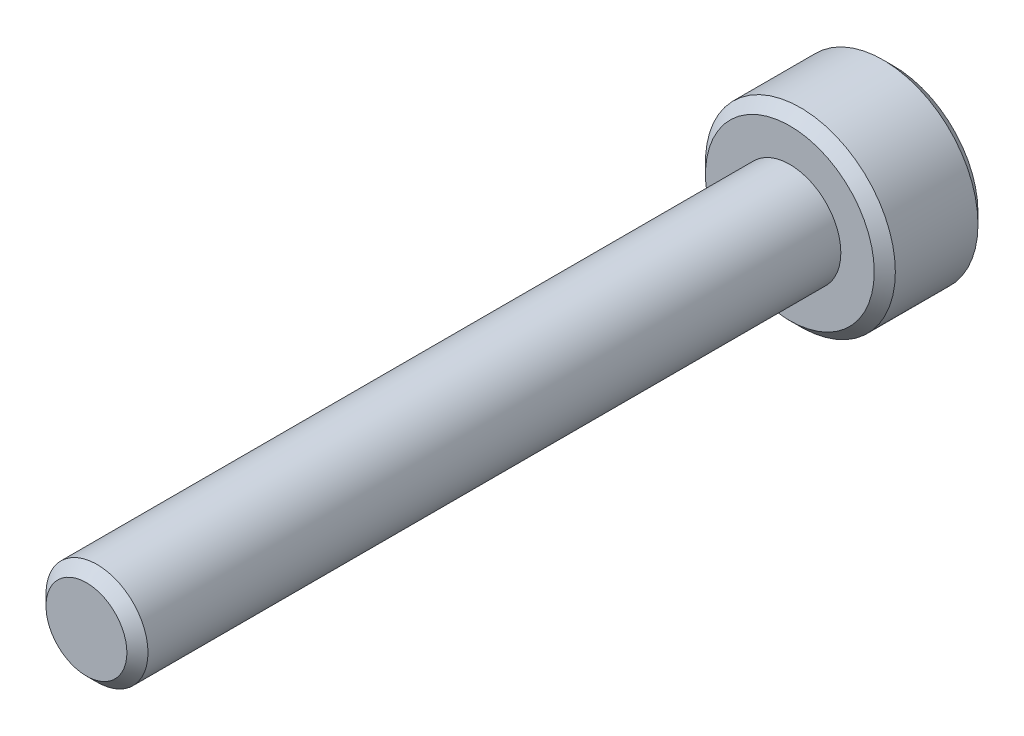
ISO-10303-21;
HEADER;
FILE_DESCRIPTION(('STEP AP214'),'2;1');
FILE_NAME('part.step','',(''),(''),'','','');
FILE_SCHEMA(('AUTOMOTIVE_DESIGN { 1 0 10303 214 1 1 1 1 }'));
ENDSEC;
DATA;
#1=APPLICATION_CONTEXT('core data for automotive mechanical design processes');
#2=APPLICATION_PROTOCOL_DEFINITION('international standard','automotive_design',2000,#1);
#3=PRODUCT_CONTEXT('',#1,'mechanical');
#4=PRODUCT('Part','Part','',(#3));
#5=PRODUCT_RELATED_PRODUCT_CATEGORY('part','',(#4));
#6=PRODUCT_DEFINITION_FORMATION('','',#4);
#7=PRODUCT_DEFINITION_CONTEXT('part definition',#1,'design');
#8=PRODUCT_DEFINITION('design','',#6,#7);
#9=PRODUCT_DEFINITION_SHAPE('','',#8);
#10=(LENGTH_UNIT() NAMED_UNIT(*) SI_UNIT(.MILLI.,.METRE.));
#11=(NAMED_UNIT(*) PLANE_ANGLE_UNIT() SI_UNIT($,.RADIAN.));
#12=(NAMED_UNIT(*) SI_UNIT($,.STERADIAN.) SOLID_ANGLE_UNIT());
#13=UNCERTAINTY_MEASURE_WITH_UNIT(LENGTH_MEASURE(1.E-05),#10,'distance_accuracy_value','');
#14=(GEOMETRIC_REPRESENTATION_CONTEXT(3) GLOBAL_UNCERTAINTY_ASSIGNED_CONTEXT((#13)) GLOBAL_UNIT_ASSIGNED_CONTEXT((#10,
#11,#12)) REPRESENTATION_CONTEXT('',''));
#15=CARTESIAN_POINT('',(0.,0.,0.));
#16=DIRECTION('',(0.,0.,1.));
#17=DIRECTION('',(1.,0.,0.));
#18=AXIS2_PLACEMENT_3D('',#15,#16,#17);
#19=CARTESIAN_POINT('',(0.,0.,2.95));
#20=DIRECTION('',(0.,0.,-1.));
#21=DIRECTION('',(-1.,0.,0.));
#22=AXIS2_PLACEMENT_3D('',#19,#20,#21);
#23=CYLINDRICAL_SURFACE('',#22,2.7);
#24=CARTESIAN_POINT('',(0.,0.,2.64999999999999));
#25=DIRECTION('',(0.,0.,1.));
#26=DIRECTION('',(1.,0.,0.));
#27=AXIS2_PLACEMENT_3D('',#24,#25,#26);
#28=CIRCLE('',#27,2.7);
#29=CARTESIAN_POINT('',(2.7,0.,2.64999999999999));
#30=VERTEX_POINT('',#29);
#31=EDGE_CURVE('E176',#30,#30,#28,.F.);
#32=ORIENTED_EDGE('',*,*,#31,.T.);
#33=EDGE_LOOP('',(#32));
#34=FACE_BOUND('',#33,.T.);
#35=CARTESIAN_POINT('',(0.,0.,0.3));
#36=DIRECTION('',(0.,0.,1.));
#37=DIRECTION('',(1.,0.,0.));
#38=AXIS2_PLACEMENT_3D('',#35,#36,#37);
#39=CIRCLE('',#38,2.7);
#40=CARTESIAN_POINT('',(2.7,0.,0.3));
#41=VERTEX_POINT('',#40);
#42=EDGE_CURVE('E172',#41,#41,#39,.T.);
#43=ORIENTED_EDGE('',*,*,#42,.T.);
#44=EDGE_LOOP('',(#43));
#45=FACE_BOUND('',#44,.T.);
#46=ADVANCED_FACE('F38',(#34,#45),#23,.T.);
#47=CARTESIAN_POINT('',(0.,0.,2.95));
#48=DIRECTION('',(0.,0.,1.));
#49=DIRECTION('',(1.,0.,0.));
#50=AXIS2_PLACEMENT_3D('',#47,#48,#49);
#51=PLANE('',#50);
#52=CARTESIAN_POINT('',(0.,0.,2.95));
#53=DIRECTION('',(0.,0.,1.));
#54=DIRECTION('',(1.,0.,0.));
#55=AXIS2_PLACEMENT_3D('',#52,#53,#54);
#56=CIRCLE('',#55,2.4);
#57=CARTESIAN_POINT('',(2.4,0.,2.95));
#58=VERTEX_POINT('',#57);
#59=EDGE_CURVE('E168',#58,#58,#56,.T.);
#60=ORIENTED_EDGE('',*,*,#59,.T.);
#61=EDGE_LOOP('',(#60));
#62=FACE_BOUND('',#61,.T.);
#63=CARTESIAN_POINT('',(0.,0.,2.95));
#64=DIRECTION('',(0.,0.,1.));
#65=DIRECTION('',(1.,0.,0.));
#66=AXIS2_PLACEMENT_3D('',#63,#64,#65);
#67=CIRCLE('',#66,1.45);
#68=CARTESIAN_POINT('',(1.45,0.,2.95));
#69=VERTEX_POINT('',#68);
#70=EDGE_CURVE('E156',#69,#69,#67,.T.);
#71=ORIENTED_EDGE('',*,*,#70,.F.);
#72=EDGE_LOOP('',(#71));
#73=FACE_BOUND('',#72,.T.);
#74=ADVANCED_FACE('F205',(#62,#73),#51,.T.);
#75=CARTESIAN_POINT('',(0.,0.,0.));
#76=DIRECTION('',(0.,0.,1.));
#77=DIRECTION('',(1.,0.,0.));
#78=AXIS2_PLACEMENT_3D('',#75,#76,#77);
#79=PLANE('',#78);
#80=DIRECTION('',(0.866025403784439,0.5,0.));
#81=VECTOR('',#80,1.);
#82=CARTESIAN_POINT('',(-1.25,0.721687836487032,0.));
#83=LINE('',#82,#81);
#84=CARTESIAN_POINT('',(-1.25,0.721687836487032,0.));
#85=VERTEX_POINT('',#84);
#86=CARTESIAN_POINT('',(0.,1.44337567297406,0.));
#87=VERTEX_POINT('',#86);
#88=EDGE_CURVE('E138',#85,#87,#83,.T.);
#89=ORIENTED_EDGE('',*,*,#88,.F.);
#90=DIRECTION('',(0.,1.,0.));
#91=VECTOR('',#90,1.);
#92=CARTESIAN_POINT('',(-1.25,-0.721687836487032,0.));
#93=LINE('',#92,#91);
#94=CARTESIAN_POINT('',(-1.25,-0.721687836487032,0.));
#95=VERTEX_POINT('',#94);
#96=EDGE_CURVE('E55',#95,#85,#93,.T.);
#97=ORIENTED_EDGE('',*,*,#96,.F.);
#98=DIRECTION('',(-0.866025403784439,0.5,0.));
#99=VECTOR('',#98,1.);
#100=CARTESIAN_POINT('',(0.,-1.44337567297406,0.));
#101=LINE('',#100,#99);
#102=CARTESIAN_POINT('',(0.,-1.44337567297406,0.));
#103=VERTEX_POINT('',#102);
#104=EDGE_CURVE('E150',#103,#95,#101,.T.);
#105=ORIENTED_EDGE('',*,*,#104,.F.);
#106=DIRECTION('',(-0.866025403784439,-0.5,0.));
#107=VECTOR('',#106,1.);
#108=CARTESIAN_POINT('',(1.25,-0.721687836487032,0.));
#109=LINE('',#108,#107);
#110=CARTESIAN_POINT('',(1.25,-0.721687836487032,0.));
#111=VERTEX_POINT('',#110);
#112=EDGE_CURVE('E147',#111,#103,#109,.T.);
#113=ORIENTED_EDGE('',*,*,#112,.F.);
#114=DIRECTION('',(0.,-1.,0.));
#115=VECTOR('',#114,1.);
#116=CARTESIAN_POINT('',(1.25,0.721687836487032,0.));
#117=LINE('',#116,#115);
#118=CARTESIAN_POINT('',(1.25,0.721687836487032,0.));
#119=VERTEX_POINT('',#118);
#120=EDGE_CURVE('E103',#119,#111,#117,.T.);
#121=ORIENTED_EDGE('',*,*,#120,.F.);
#122=DIRECTION('',(0.866025403784439,-0.5,0.));
#123=VECTOR('',#122,1.);
#124=CARTESIAN_POINT('',(0.,1.44337567297406,0.));
#125=LINE('',#124,#123);
#126=EDGE_CURVE('E142',#87,#119,#125,.T.);
#127=ORIENTED_EDGE('',*,*,#126,.F.);
#128=EDGE_LOOP('',(#89,#97,#105,#113,#121,#127));
#129=FACE_BOUND('',#128,.T.);
#130=CARTESIAN_POINT('',(0.,0.,0.));
#131=DIRECTION('',(0.,0.,1.));
#132=DIRECTION('',(1.,0.,0.));
#133=AXIS2_PLACEMENT_3D('',#130,#131,#132);
#134=CIRCLE('',#133,2.4);
#135=CARTESIAN_POINT('',(2.4,0.,0.));
#136=VERTEX_POINT('',#135);
#137=EDGE_CURVE('E180',#136,#136,#134,.F.);
#138=ORIENTED_EDGE('',*,*,#137,.T.);
#139=EDGE_LOOP('',(#138));
#140=FACE_BOUND('',#139,.T.);
#141=ADVANCED_FACE('F211',(#129,#140),#79,.F.);
#142=CARTESIAN_POINT('',(0.,0.,22.95));
#143=DIRECTION('',(0.,0.,-1.));
#144=DIRECTION('',(-1.,0.,0.));
#145=AXIS2_PLACEMENT_3D('',#142,#143,#144);
#146=CYLINDRICAL_SURFACE('',#145,1.45);
#147=CARTESIAN_POINT('',(0.,0.,22.65));
#148=DIRECTION('',(0.,0.,1.));
#149=DIRECTION('',(1.,0.,0.));
#150=AXIS2_PLACEMENT_3D('',#147,#148,#149);
#151=CIRCLE('',#150,1.45);
#152=CARTESIAN_POINT('',(1.45,0.,22.65));
#153=VERTEX_POINT('',#152);
#154=EDGE_CURVE('E11',#153,#153,#151,.F.);
#155=ORIENTED_EDGE('',*,*,#154,.T.);
#156=EDGE_LOOP('',(#155));
#157=FACE_BOUND('',#156,.T.);
#158=ORIENTED_EDGE('',*,*,#70,.T.);
#159=EDGE_LOOP('',(#158));
#160=FACE_BOUND('',#159,.T.);
#161=ADVANCED_FACE('F230',(#157,#160),#146,.T.);
#162=CARTESIAN_POINT('',(0.,0.,22.95));
#163=DIRECTION('',(0.,0.,1.));
#164=DIRECTION('',(1.,0.,0.));
#165=AXIS2_PLACEMENT_3D('',#162,#163,#164);
#166=PLANE('',#165);
#167=CARTESIAN_POINT('',(0.,0.,22.95));
#168=DIRECTION('',(0.,0.,1.));
#169=DIRECTION('',(1.,0.,0.));
#170=AXIS2_PLACEMENT_3D('',#167,#168,#169);
#171=CIRCLE('',#170,1.15);
#172=CARTESIAN_POINT('',(1.15,0.,22.95));
#173=VERTEX_POINT('',#172);
#174=EDGE_CURVE('E48',#173,#173,#171,.T.);
#175=ORIENTED_EDGE('',*,*,#174,.T.);
#176=EDGE_LOOP('',(#175));
#177=FACE_BOUND('',#176,.T.);
#178=ADVANCED_FACE('F189',(#177),#166,.T.);
#179=CARTESIAN_POINT('',(0.,0.,2.95));
#180=DIRECTION('',(0.,0.,-1.));
#181=DIRECTION('',(-1.,0.,0.));
#182=AXIS2_PLACEMENT_3D('',#179,#180,#181);
#183=CONICAL_SURFACE('',#182,2.4,0.785398163397443);
#184=ORIENTED_EDGE('',*,*,#31,.F.);
#185=EDGE_LOOP('',(#184));
#186=FACE_BOUND('',#185,.T.);
#187=ORIENTED_EDGE('',*,*,#59,.F.);
#188=EDGE_LOOP('',(#187));
#189=FACE_BOUND('',#188,.T.);
#190=ADVANCED_FACE('F201',(#186,#189),#183,.T.);
#191=CARTESIAN_POINT('',(0.,0.,0.3));
#192=DIRECTION('',(0.,0.,1.));
#193=DIRECTION('',(1.,0.,0.));
#194=AXIS2_PLACEMENT_3D('',#191,#192,#193);
#195=CONICAL_SURFACE('',#194,2.7,0.78539816339745);
#196=ORIENTED_EDGE('',*,*,#137,.F.);
#197=EDGE_LOOP('',(#196));
#198=FACE_BOUND('',#197,.T.);
#199=ORIENTED_EDGE('',*,*,#42,.F.);
#200=EDGE_LOOP('',(#199));
#201=FACE_BOUND('',#200,.T.);
#202=ADVANCED_FACE('F193',(#198,#201),#195,.T.);
#203=CARTESIAN_POINT('',(0.,0.,22.95));
#204=DIRECTION('',(0.,0.,-1.));
#205=DIRECTION('',(-1.,0.,0.));
#206=AXIS2_PLACEMENT_3D('',#203,#204,#205);
#207=CONICAL_SURFACE('',#206,1.15,0.785398163397443);
#208=ORIENTED_EDGE('',*,*,#154,.F.);
#209=EDGE_LOOP('',(#208));
#210=FACE_BOUND('',#209,.T.);
#211=ORIENTED_EDGE('',*,*,#174,.F.);
#212=EDGE_LOOP('',(#211));
#213=FACE_BOUND('',#212,.T.);
#214=ADVANCED_FACE('F41',(#210,#213),#207,.T.);
#215=CARTESIAN_POINT('',(-1.25,-0.721687836487032,2.5));
#216=DIRECTION('',(-1.,0.,0.));
#217=DIRECTION('',(0.,-1.,0.));
#218=AXIS2_PLACEMENT_3D('',#215,#216,#217);
#219=PLANE('',#218);
#220=ORIENTED_EDGE('',*,*,#96,.T.);
#221=DIRECTION('',(0.,0.,-1.));
#222=VECTOR('',#221,1.);
#223=CARTESIAN_POINT('',(-1.25,0.721687836487032,2.5));
#224=LINE('',#223,#222);
#225=CARTESIAN_POINT('',(-1.25,0.721687836487032,2.5));
#226=VERTEX_POINT('',#225);
#227=EDGE_CURVE('E85',#226,#85,#224,.T.);
#228=ORIENTED_EDGE('',*,*,#227,.F.);
#229=DIRECTION('',(0.,1.,0.));
#230=VECTOR('',#229,1.);
#231=CARTESIAN_POINT('',(-1.25,-0.721687836487032,2.5));
#232=LINE('',#231,#230);
#233=CARTESIAN_POINT('',(-1.25,-0.721687836487032,2.5));
#234=VERTEX_POINT('',#233);
#235=EDGE_CURVE('E153',#234,#226,#232,.T.);
#236=ORIENTED_EDGE('',*,*,#235,.F.);
#237=DIRECTION('',(0.,0.,-1.));
#238=VECTOR('',#237,1.);
#239=CARTESIAN_POINT('',(-1.25,-0.721687836487032,2.5));
#240=LINE('',#239,#238);
#241=EDGE_CURVE('E63',#234,#95,#240,.T.);
#242=ORIENTED_EDGE('',*,*,#241,.T.);
#243=EDGE_LOOP('',(#220,#228,#236,#242));
#244=FACE_BOUND('',#243,.T.);
#245=ADVANCED_FACE('F192',(#244),#219,.F.);
#246=CARTESIAN_POINT('',(0.,-1.44337567297406,2.5));
#247=DIRECTION('',(-0.5,-0.866025403784439,0.));
#248=DIRECTION('',(0.866025403784439,-0.5,0.));
#249=AXIS2_PLACEMENT_3D('',#246,#247,#248);
#250=PLANE('',#249);
#251=ORIENTED_EDGE('',*,*,#104,.T.);
#252=ORIENTED_EDGE('',*,*,#241,.F.);
#253=DIRECTION('',(-0.866025403784439,0.5,0.));
#254=VECTOR('',#253,1.);
#255=CARTESIAN_POINT('',(0.,-1.44337567297406,2.5));
#256=LINE('',#255,#254);
#257=CARTESIAN_POINT('',(0.,-1.44337567297406,2.5));
#258=VERTEX_POINT('',#257);
#259=EDGE_CURVE('E117',#258,#234,#256,.T.);
#260=ORIENTED_EDGE('',*,*,#259,.F.);
#261=DIRECTION('',(0.,0.,-1.));
#262=VECTOR('',#261,1.);
#263=CARTESIAN_POINT('',(0.,-1.44337567297406,2.5));
#264=LINE('',#263,#262);
#265=EDGE_CURVE('E108',#258,#103,#264,.T.);
#266=ORIENTED_EDGE('',*,*,#265,.T.);
#267=EDGE_LOOP('',(#251,#252,#260,#266));
#268=FACE_BOUND('',#267,.T.);
#269=ADVANCED_FACE('F199',(#268),#250,.F.);
#270=CARTESIAN_POINT('',(1.25,-0.721687836487032,2.5));
#271=DIRECTION('',(0.5,-0.866025403784439,0.));
#272=DIRECTION('',(0.866025403784439,0.5,0.));
#273=AXIS2_PLACEMENT_3D('',#270,#271,#272);
#274=PLANE('',#273);
#275=ORIENTED_EDGE('',*,*,#112,.T.);
#276=ORIENTED_EDGE('',*,*,#265,.F.);
#277=DIRECTION('',(-0.866025403784439,-0.5,0.));
#278=VECTOR('',#277,1.);
#279=CARTESIAN_POINT('',(1.25,-0.721687836487032,2.5));
#280=LINE('',#279,#278);
#281=CARTESIAN_POINT('',(1.25,-0.721687836487032,2.5));
#282=VERTEX_POINT('',#281);
#283=EDGE_CURVE('E112',#282,#258,#280,.T.);
#284=ORIENTED_EDGE('',*,*,#283,.F.);
#285=DIRECTION('',(0.,0.,-1.));
#286=VECTOR('',#285,1.);
#287=CARTESIAN_POINT('',(1.25,-0.721687836487032,2.5));
#288=LINE('',#287,#286);
#289=EDGE_CURVE('E96',#282,#111,#288,.T.);
#290=ORIENTED_EDGE('',*,*,#289,.T.);
#291=EDGE_LOOP('',(#275,#276,#284,#290));
#292=FACE_BOUND('',#291,.T.);
#293=ADVANCED_FACE('F113',(#292),#274,.F.);
#294=CARTESIAN_POINT('',(1.25,0.721687836487032,2.5));
#295=DIRECTION('',(1.,0.,0.));
#296=DIRECTION('',(0.,1.,0.));
#297=AXIS2_PLACEMENT_3D('',#294,#295,#296);
#298=PLANE('',#297);
#299=ORIENTED_EDGE('',*,*,#120,.T.);
#300=ORIENTED_EDGE('',*,*,#289,.F.);
#301=DIRECTION('',(0.,-1.,0.));
#302=VECTOR('',#301,1.);
#303=CARTESIAN_POINT('',(1.25,0.721687836487032,2.5));
#304=LINE('',#303,#302);
#305=CARTESIAN_POINT('',(1.25,0.721687836487032,2.5));
#306=VERTEX_POINT('',#305);
#307=EDGE_CURVE('E100',#306,#282,#304,.T.);
#308=ORIENTED_EDGE('',*,*,#307,.F.);
#309=DIRECTION('',(0.,0.,-1.));
#310=VECTOR('',#309,1.);
#311=CARTESIAN_POINT('',(1.25,0.721687836487032,2.5));
#312=LINE('',#311,#310);
#313=EDGE_CURVE('E109',#306,#119,#312,.T.);
#314=ORIENTED_EDGE('',*,*,#313,.T.);
#315=EDGE_LOOP('',(#299,#300,#308,#314));
#316=FACE_BOUND('',#315,.T.);
#317=ADVANCED_FACE('F98',(#316),#298,.F.);
#318=CARTESIAN_POINT('',(0.,1.44337567297406,2.5));
#319=DIRECTION('',(0.5,0.866025403784438,0.));
#320=DIRECTION('',(-0.866025403784439,0.5,0.));
#321=AXIS2_PLACEMENT_3D('',#318,#319,#320);
#322=PLANE('',#321);
#323=ORIENTED_EDGE('',*,*,#126,.T.);
#324=ORIENTED_EDGE('',*,*,#313,.F.);
#325=DIRECTION('',(0.866025403784439,-0.5,0.));
#326=VECTOR('',#325,1.);
#327=CARTESIAN_POINT('',(0.,1.44337567297406,2.5));
#328=LINE('',#327,#326);
#329=CARTESIAN_POINT('',(0.,1.44337567297406,2.5));
#330=VERTEX_POINT('',#329);
#331=EDGE_CURVE('E123',#330,#306,#328,.T.);
#332=ORIENTED_EDGE('',*,*,#331,.F.);
#333=DIRECTION('',(0.,0.,-1.));
#334=VECTOR('',#333,1.);
#335=CARTESIAN_POINT('',(0.,1.44337567297406,2.5));
#336=LINE('',#335,#334);
#337=EDGE_CURVE('E160',#330,#87,#336,.T.);
#338=ORIENTED_EDGE('',*,*,#337,.T.);
#339=EDGE_LOOP('',(#323,#324,#332,#338));
#340=FACE_BOUND('',#339,.T.);
#341=ADVANCED_FACE('F249',(#340),#322,.F.);
#342=CARTESIAN_POINT('',(-1.25,0.721687836487032,2.5));
#343=DIRECTION('',(-0.5,0.866025403784439,0.));
#344=DIRECTION('',(-0.866025403784439,-0.5,0.));
#345=AXIS2_PLACEMENT_3D('',#342,#343,#344);
#346=PLANE('',#345);
#347=ORIENTED_EDGE('',*,*,#88,.T.);
#348=ORIENTED_EDGE('',*,*,#337,.F.);
#349=DIRECTION('',(0.866025403784439,0.5,0.));
#350=VECTOR('',#349,1.);
#351=CARTESIAN_POINT('',(-1.25,0.721687836487032,2.5));
#352=LINE('',#351,#350);
#353=EDGE_CURVE('E130',#226,#330,#352,.T.);
#354=ORIENTED_EDGE('',*,*,#353,.F.);
#355=ORIENTED_EDGE('',*,*,#227,.T.);
#356=EDGE_LOOP('',(#347,#348,#354,#355));
#357=FACE_BOUND('',#356,.T.);
#358=ADVANCED_FACE('F246',(#357),#346,.F.);
#359=CARTESIAN_POINT('',(0.,0.,2.5));
#360=DIRECTION('',(0.,0.,-1.));
#361=DIRECTION('',(-1.,0.,0.));
#362=AXIS2_PLACEMENT_3D('',#359,#360,#361);
#363=PLANE('',#362);
#364=ORIENTED_EDGE('',*,*,#235,.T.);
#365=ORIENTED_EDGE('',*,*,#353,.T.);
#366=ORIENTED_EDGE('',*,*,#331,.T.);
#367=ORIENTED_EDGE('',*,*,#307,.T.);
#368=ORIENTED_EDGE('',*,*,#283,.T.);
#369=ORIENTED_EDGE('',*,*,#259,.T.);
#370=EDGE_LOOP('',(#364,#365,#366,#367,#368,#369));
#371=FACE_BOUND('',#370,.T.);
#372=ADVANCED_FACE('F120',(#371),#363,.T.);
#373=CLOSED_SHELL('',(#46,#74,#141,#161,#178,#190,#202,#214,#245,#269,#293,#317,#341,#358,#372));
#374=MANIFOLD_SOLID_BREP('B2',#373);
#375=ADVANCED_BREP_SHAPE_REPRESENTATION('',(#18,#374),#14);
#376=SHAPE_DEFINITION_REPRESENTATION(#9,#375);
ENDSEC;
END-ISO-10303-21;
